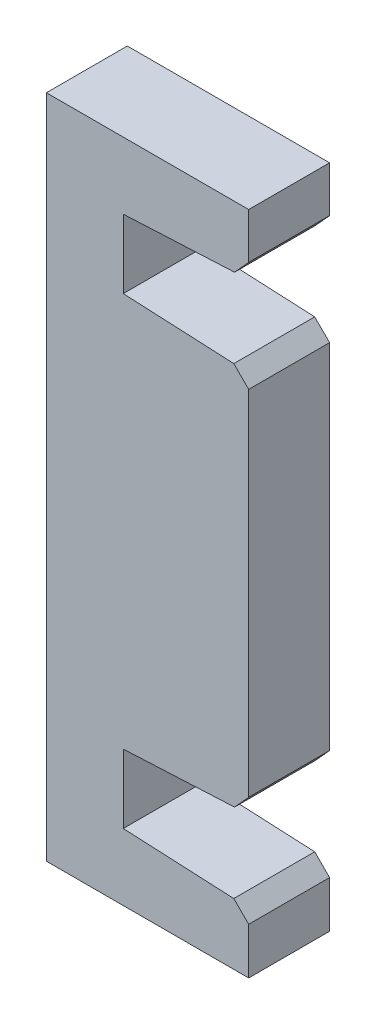
ISO-10303-21;
HEADER;
FILE_DESCRIPTION(('STEP AP214'),'2;1');
FILE_NAME('part.step','',(''),(''),'','','');
FILE_SCHEMA(('AUTOMOTIVE_DESIGN { 1 0 10303 214 1 1 1 1 }'));
ENDSEC;
DATA;
#1=APPLICATION_CONTEXT('core data for automotive mechanical design processes');
#2=APPLICATION_PROTOCOL_DEFINITION('international standard','automotive_design',2000,#1);
#3=PRODUCT_CONTEXT('',#1,'mechanical');
#4=PRODUCT('Part','Part','',(#3));
#5=PRODUCT_RELATED_PRODUCT_CATEGORY('part','',(#4));
#6=PRODUCT_DEFINITION_FORMATION('','',#4);
#7=PRODUCT_DEFINITION_CONTEXT('part definition',#1,'design');
#8=PRODUCT_DEFINITION('design','',#6,#7);
#9=PRODUCT_DEFINITION_SHAPE('','',#8);
#10=(LENGTH_UNIT() NAMED_UNIT(*) SI_UNIT(.MILLI.,.METRE.));
#11=(NAMED_UNIT(*) PLANE_ANGLE_UNIT() SI_UNIT($,.RADIAN.));
#12=(NAMED_UNIT(*) SI_UNIT($,.STERADIAN.) SOLID_ANGLE_UNIT());
#13=UNCERTAINTY_MEASURE_WITH_UNIT(LENGTH_MEASURE(1.E-05),#10,'distance_accuracy_value','');
#14=(GEOMETRIC_REPRESENTATION_CONTEXT(3) GLOBAL_UNCERTAINTY_ASSIGNED_CONTEXT((#13)) GLOBAL_UNIT_ASSIGNED_CONTEXT((#10,
#11,#12)) REPRESENTATION_CONTEXT('',''));
#15=CARTESIAN_POINT('',(0.,0.,0.));
#16=DIRECTION('',(0.,0.,1.));
#17=DIRECTION('',(1.,0.,0.));
#18=AXIS2_PLACEMENT_3D('',#15,#16,#17);
#19=CARTESIAN_POINT('',(-10.,0.,4.));
#20=DIRECTION('',(1.,0.,0.));
#21=DIRECTION('',(0.,0.,-1.));
#22=AXIS2_PLACEMENT_3D('',#19,#20,#21);
#23=PLANE('',#22);
#24=DIRECTION('',(0.,-1.,0.));
#25=VECTOR('',#24,1.);
#26=CARTESIAN_POINT('',(-10.,0.,0.));
#27=LINE('',#26,#25);
#28=CARTESIAN_POINT('',(-10.,16.45,0.));
#29=VERTEX_POINT('',#28);
#30=CARTESIAN_POINT('',(-10.,-16.45,0.));
#31=VERTEX_POINT('',#30);
#32=EDGE_CURVE('E167',#29,#31,#27,.T.);
#33=ORIENTED_EDGE('',*,*,#32,.T.);
#34=DIRECTION('',(0.,0.,-1.));
#35=VECTOR('',#34,1.);
#36=CARTESIAN_POINT('',(-10.,-16.45,4.));
#37=LINE('',#36,#35);
#38=CARTESIAN_POINT('',(-10.,-16.45,4.));
#39=VERTEX_POINT('',#38);
#40=EDGE_CURVE('E165',#39,#31,#37,.T.);
#41=ORIENTED_EDGE('',*,*,#40,.F.);
#42=DIRECTION('',(0.,-1.,0.));
#43=VECTOR('',#42,1.);
#44=CARTESIAN_POINT('',(-10.,0.,4.));
#45=LINE('',#44,#43);
#46=CARTESIAN_POINT('',(-10.,16.45,4.));
#47=VERTEX_POINT('',#46);
#48=EDGE_CURVE('E150',#47,#39,#45,.T.);
#49=ORIENTED_EDGE('',*,*,#48,.F.);
#50=DIRECTION('',(0.,0.,-1.));
#51=VECTOR('',#50,1.);
#52=CARTESIAN_POINT('',(-10.,16.45,4.));
#53=LINE('',#52,#51);
#54=EDGE_CURVE('E201',#47,#29,#53,.T.);
#55=ORIENTED_EDGE('',*,*,#54,.T.);
#56=EDGE_LOOP('',(#33,#41,#49,#55));
#57=FACE_BOUND('',#56,.T.);
#58=ADVANCED_FACE('F37',(#57),#23,.F.);
#59=CARTESIAN_POINT('',(0.,-16.45,4.));
#60=DIRECTION('',(0.,-1.,0.));
#61=DIRECTION('',(0.,0.,-1.));
#62=AXIS2_PLACEMENT_3D('',#59,#60,#61);
#63=PLANE('',#62);
#64=DIRECTION('',(-1.,0.,0.));
#65=VECTOR('',#64,1.);
#66=CARTESIAN_POINT('',(0.,-16.45,0.));
#67=LINE('',#66,#65);
#68=CARTESIAN_POINT('',(0.,-16.45,0.));
#69=VERTEX_POINT('',#68);
#70=EDGE_CURVE('E203',#69,#31,#67,.T.);
#71=ORIENTED_EDGE('',*,*,#70,.F.);
#72=DIRECTION('',(0.,0.,-1.));
#73=VECTOR('',#72,1.);
#74=CARTESIAN_POINT('',(0.,-16.45,4.));
#75=LINE('',#74,#73);
#76=CARTESIAN_POINT('',(0.,-16.45,4.));
#77=VERTEX_POINT('',#76);
#78=EDGE_CURVE('E172',#77,#69,#75,.T.);
#79=ORIENTED_EDGE('',*,*,#78,.F.);
#80=DIRECTION('',(-1.,0.,0.));
#81=VECTOR('',#80,1.);
#82=CARTESIAN_POINT('',(0.,-16.45,4.));
#83=LINE('',#82,#81);
#84=EDGE_CURVE('E156',#77,#39,#83,.T.);
#85=ORIENTED_EDGE('',*,*,#84,.T.);
#86=ORIENTED_EDGE('',*,*,#40,.T.);
#87=EDGE_LOOP('',(#71,#79,#85,#86));
#88=FACE_BOUND('',#87,.T.);
#89=ADVANCED_FACE('F175',(#88),#63,.T.);
#90=CARTESIAN_POINT('',(0.,0.,4.));
#91=DIRECTION('',(1.,0.,0.));
#92=DIRECTION('',(0.,1.,0.));
#93=AXIS2_PLACEMENT_3D('',#90,#91,#92);
#94=PLANE('',#93);
#95=DIRECTION('',(0.,-1.,0.));
#96=VECTOR('',#95,1.);
#97=CARTESIAN_POINT('',(0.,0.,0.));
#98=LINE('',#97,#96);
#99=CARTESIAN_POINT('',(0.,-14.15,0.));
#100=VERTEX_POINT('',#99);
#101=EDGE_CURVE('E205',#100,#69,#98,.T.);
#102=ORIENTED_EDGE('',*,*,#101,.F.);
#103=DIRECTION('',(0.,0.,1.));
#104=VECTOR('',#103,1.);
#105=CARTESIAN_POINT('',(0.,-14.15,4.));
#106=LINE('',#105,#104);
#107=CARTESIAN_POINT('',(0.,-14.15,4.));
#108=VERTEX_POINT('',#107);
#109=EDGE_CURVE('E267',#100,#108,#106,.T.);
#110=ORIENTED_EDGE('',*,*,#109,.T.);
#111=DIRECTION('',(0.,-1.,0.));
#112=VECTOR('',#111,1.);
#113=CARTESIAN_POINT('',(0.,0.,4.));
#114=LINE('',#113,#112);
#115=EDGE_CURVE('E177',#108,#77,#114,.T.);
#116=ORIENTED_EDGE('',*,*,#115,.T.);
#117=ORIENTED_EDGE('',*,*,#78,.T.);
#118=EDGE_LOOP('',(#102,#110,#116,#117));
#119=FACE_BOUND('',#118,.T.);
#120=ADVANCED_FACE('F300',(#119),#94,.T.);
#121=CARTESIAN_POINT('',(-0.649286270438619,-13.4185829223981,4.));
#122=DIRECTION('',(0.0483305514233226,0.998831396082,0.));
#123=DIRECTION('',(-0.998831396082,0.0483305514233226,0.));
#124=AXIS2_PLACEMENT_3D('',#121,#122,#123);
#125=PLANE('',#124);
#126=DIRECTION('',(0.998831396082,-0.0483305514233226,0.));
#127=VECTOR('',#126,1.);
#128=CARTESIAN_POINT('',(-0.649286270438619,-13.4185829223981,4.));
#129=LINE('',#128,#127);
#130=CARTESIAN_POINT('',(-6.20000000000002,-13.15,4.));
#131=VERTEX_POINT('',#130);
#132=CARTESIAN_POINT('',(-0.735593220338908,-13.414406779661,4.));
#133=VERTEX_POINT('',#132);
#134=EDGE_CURVE('E179',#131,#133,#129,.T.);
#135=ORIENTED_EDGE('',*,*,#134,.T.);
#136=DIRECTION('',(0.,0.,-1.));
#137=VECTOR('',#136,1.);
#138=CARTESIAN_POINT('',(-0.735593220338908,-13.414406779661,4.));
#139=LINE('',#138,#137);
#140=CARTESIAN_POINT('',(-0.735593220338908,-13.414406779661,0.));
#141=VERTEX_POINT('',#140);
#142=EDGE_CURVE('E264',#133,#141,#139,.T.);
#143=ORIENTED_EDGE('',*,*,#142,.T.);
#144=DIRECTION('',(0.998831396082,-0.0483305514233226,0.));
#145=VECTOR('',#144,1.);
#146=CARTESIAN_POINT('',(-0.649286270438619,-13.4185829223981,0.));
#147=LINE('',#146,#145);
#148=CARTESIAN_POINT('',(-6.20000000000002,-13.15,0.));
#149=VERTEX_POINT('',#148);
#150=EDGE_CURVE('E207',#149,#141,#147,.T.);
#151=ORIENTED_EDGE('',*,*,#150,.F.);
#152=DIRECTION('',(0.,0.,-1.));
#153=VECTOR('',#152,1.);
#154=CARTESIAN_POINT('',(-6.20000000000002,-13.15,4.));
#155=LINE('',#154,#153);
#156=EDGE_CURVE('E240',#131,#149,#155,.T.);
#157=ORIENTED_EDGE('',*,*,#156,.F.);
#158=EDGE_LOOP('',(#135,#143,#151,#157));
#159=FACE_BOUND('',#158,.T.);
#160=ADVANCED_FACE('F356',(#159),#125,.T.);
#161=CARTESIAN_POINT('',(-6.20000000000002,0.,4.));
#162=DIRECTION('',(1.,0.,0.));
#163=DIRECTION('',(0.,1.,0.));
#164=AXIS2_PLACEMENT_3D('',#161,#162,#163);
#165=PLANE('',#164);
#166=DIRECTION('',(0.,-1.,0.));
#167=VECTOR('',#166,1.);
#168=CARTESIAN_POINT('',(-6.20000000000002,0.,0.));
#169=LINE('',#168,#167);
#170=CARTESIAN_POINT('',(-6.20000000000002,-9.75,0.));
#171=VERTEX_POINT('',#170);
#172=EDGE_CURVE('E210',#171,#149,#169,.T.);
#173=ORIENTED_EDGE('',*,*,#172,.F.);
#174=DIRECTION('',(0.,0.,-1.));
#175=VECTOR('',#174,1.);
#176=CARTESIAN_POINT('',(-6.20000000000002,-9.75,4.));
#177=LINE('',#176,#175);
#178=CARTESIAN_POINT('',(-6.20000000000002,-9.75,4.));
#179=VERTEX_POINT('',#178);
#180=EDGE_CURVE('E237',#179,#171,#177,.T.);
#181=ORIENTED_EDGE('',*,*,#180,.F.);
#182=DIRECTION('',(0.,-1.,0.));
#183=VECTOR('',#182,1.);
#184=CARTESIAN_POINT('',(-6.20000000000002,0.,4.));
#185=LINE('',#184,#183);
#186=EDGE_CURVE('E184',#179,#131,#185,.T.);
#187=ORIENTED_EDGE('',*,*,#186,.T.);
#188=ORIENTED_EDGE('',*,*,#156,.T.);
#189=EDGE_LOOP('',(#173,#181,#187,#188));
#190=FACE_BOUND('',#189,.T.);
#191=ADVANCED_FACE('F352',(#190),#165,.T.);
#192=CARTESIAN_POINT('',(0.456189981832338,-9.42792629120166,4.));
#193=DIRECTION('',(0.0483305514233226,-0.998831396082,0.));
#194=DIRECTION('',(0.998831396082,0.0483305514233226,0.));
#195=AXIS2_PLACEMENT_3D('',#192,#193,#194);
#196=PLANE('',#195);
#197=DIRECTION('',(-0.998831396082,-0.0483305514233226,0.));
#198=VECTOR('',#197,1.);
#199=CARTESIAN_POINT('',(0.456189981832338,-9.42792629120166,0.));
#200=LINE('',#199,#198);
#201=CARTESIAN_POINT('',(-0.699181977257407,-9.48383138599633,0.));
#202=VERTEX_POINT('',#201);
#203=EDGE_CURVE('E213',#202,#171,#200,.T.);
#204=ORIENTED_EDGE('',*,*,#203,.F.);
#205=DIRECTION('',(0.,0.,1.));
#206=VECTOR('',#205,1.);
#207=CARTESIAN_POINT('',(-0.699181977257407,-9.48383138599633,4.));
#208=LINE('',#207,#206);
#209=CARTESIAN_POINT('',(-0.699181977257407,-9.48383138599633,4.));
#210=VERTEX_POINT('',#209);
#211=EDGE_CURVE('E255',#202,#210,#208,.T.);
#212=ORIENTED_EDGE('',*,*,#211,.T.);
#213=DIRECTION('',(-0.998831396082,-0.0483305514233226,0.));
#214=VECTOR('',#213,1.);
#215=CARTESIAN_POINT('',(0.456189981832338,-9.42792629120166,4.));
#216=LINE('',#215,#214);
#217=EDGE_CURVE('E187',#210,#179,#216,.T.);
#218=ORIENTED_EDGE('',*,*,#217,.T.);
#219=ORIENTED_EDGE('',*,*,#180,.T.);
#220=EDGE_LOOP('',(#204,#212,#218,#219));
#221=FACE_BOUND('',#220,.T.);
#222=ADVANCED_FACE('F347',(#221),#196,.T.);
#223=CARTESIAN_POINT('',(0.,0.,4.));
#224=DIRECTION('',(-1.,0.,0.));
#225=DIRECTION('',(0.,-1.,0.));
#226=AXIS2_PLACEMENT_3D('',#223,#224,#225);
#227=PLANE('',#226);
#228=DIRECTION('',(0.,1.,0.));
#229=VECTOR('',#228,1.);
#230=CARTESIAN_POINT('',(0.,0.,4.));
#231=LINE('',#230,#229);
#232=CARTESIAN_POINT('',(0.,-8.71354615681445,4.));
#233=VERTEX_POINT('',#232);
#234=CARTESIAN_POINT('',(0.,8.75,4.));
#235=VERTEX_POINT('',#234);
#236=EDGE_CURVE('E189',#233,#235,#231,.T.);
#237=ORIENTED_EDGE('',*,*,#236,.F.);
#238=DIRECTION('',(0.,0.,-1.));
#239=VECTOR('',#238,1.);
#240=CARTESIAN_POINT('',(0.,-8.71354615681445,0.));
#241=LINE('',#240,#239);
#242=CARTESIAN_POINT('',(0.,-8.71354615681445,0.));
#243=VERTEX_POINT('',#242);
#244=EDGE_CURVE('E244',#233,#243,#241,.T.);
#245=ORIENTED_EDGE('',*,*,#244,.T.);
#246=DIRECTION('',(0.,1.,0.));
#247=VECTOR('',#246,1.);
#248=CARTESIAN_POINT('',(0.,0.,0.));
#249=LINE('',#248,#247);
#250=CARTESIAN_POINT('',(0.,8.75,0.));
#251=VERTEX_POINT('',#250);
#252=EDGE_CURVE('E215',#243,#251,#249,.T.);
#253=ORIENTED_EDGE('',*,*,#252,.T.);
#254=DIRECTION('',(0.,0.,1.));
#255=VECTOR('',#254,1.);
#256=CARTESIAN_POINT('',(0.,8.75,4.));
#257=LINE('',#256,#255);
#258=EDGE_CURVE('E171',#251,#235,#257,.T.);
#259=ORIENTED_EDGE('',*,*,#258,.T.);
#260=EDGE_LOOP('',(#237,#245,#253,#259));
#261=FACE_BOUND('',#260,.T.);
#262=ADVANCED_FACE('F341',(#261),#227,.F.);
#263=CARTESIAN_POINT('',(0.456189981832333,9.42792629120167,4.));
#264=DIRECTION('',(-0.048330551423322,-0.998831396082,0.));
#265=DIRECTION('',(0.998831396082,-0.048330551423322,0.));
#266=AXIS2_PLACEMENT_3D('',#263,#264,#265);
#267=PLANE('',#266);
#268=DIRECTION('',(-0.998831396082,0.048330551423322,0.));
#269=VECTOR('',#268,1.);
#270=CARTESIAN_POINT('',(0.456189981832333,9.42792629120167,4.));
#271=LINE('',#270,#269);
#272=CARTESIAN_POINT('',(-0.735593220338984,9.48559322033899,4.));
#273=VERTEX_POINT('',#272);
#274=CARTESIAN_POINT('',(-6.20000000000002,9.75,4.));
#275=VERTEX_POINT('',#274);
#276=EDGE_CURVE('E192',#273,#275,#271,.T.);
#277=ORIENTED_EDGE('',*,*,#276,.F.);
#278=DIRECTION('',(0.,0.,-1.));
#279=VECTOR('',#278,1.);
#280=CARTESIAN_POINT('',(-0.735593220338983,9.48559322033899,4.));
#281=LINE('',#280,#279);
#282=CARTESIAN_POINT('',(-0.735593220338984,9.48559322033899,0.));
#283=VERTEX_POINT('',#282);
#284=EDGE_CURVE('E269',#273,#283,#281,.T.);
#285=ORIENTED_EDGE('',*,*,#284,.T.);
#286=DIRECTION('',(-0.998831396082,0.048330551423322,0.));
#287=VECTOR('',#286,1.);
#288=CARTESIAN_POINT('',(0.456189981832333,9.42792629120167,0.));
#289=LINE('',#288,#287);
#290=CARTESIAN_POINT('',(-6.20000000000002,9.75,0.));
#291=VERTEX_POINT('',#290);
#292=EDGE_CURVE('E218',#283,#291,#289,.T.);
#293=ORIENTED_EDGE('',*,*,#292,.T.);
#294=DIRECTION('',(0.,0.,-1.));
#295=VECTOR('',#294,1.);
#296=CARTESIAN_POINT('',(-6.20000000000002,9.75,4.));
#297=LINE('',#296,#295);
#298=EDGE_CURVE('E234',#275,#291,#297,.T.);
#299=ORIENTED_EDGE('',*,*,#298,.F.);
#300=EDGE_LOOP('',(#277,#285,#293,#299));
#301=FACE_BOUND('',#300,.T.);
#302=ADVANCED_FACE('F333',(#301),#267,.F.);
#303=CARTESIAN_POINT('',(-6.20000000000002,0.,4.));
#304=DIRECTION('',(-1.,0.,0.));
#305=DIRECTION('',(0.,-1.,0.));
#306=AXIS2_PLACEMENT_3D('',#303,#304,#305);
#307=PLANE('',#306);
#308=DIRECTION('',(0.,1.,0.));
#309=VECTOR('',#308,1.);
#310=CARTESIAN_POINT('',(-6.20000000000002,0.,0.));
#311=LINE('',#310,#309);
#312=CARTESIAN_POINT('',(-6.20000000000002,13.15,0.));
#313=VERTEX_POINT('',#312);
#314=EDGE_CURVE('E220',#291,#313,#311,.T.);
#315=ORIENTED_EDGE('',*,*,#314,.T.);
#316=DIRECTION('',(0.,0.,-1.));
#317=VECTOR('',#316,1.);
#318=CARTESIAN_POINT('',(-6.20000000000002,13.15,4.));
#319=LINE('',#318,#317);
#320=CARTESIAN_POINT('',(-6.20000000000002,13.15,4.));
#321=VERTEX_POINT('',#320);
#322=EDGE_CURVE('E231',#321,#313,#319,.T.);
#323=ORIENTED_EDGE('',*,*,#322,.F.);
#324=DIRECTION('',(0.,1.,0.));
#325=VECTOR('',#324,1.);
#326=CARTESIAN_POINT('',(-6.20000000000002,0.,4.));
#327=LINE('',#326,#325);
#328=EDGE_CURVE('E194',#275,#321,#327,.T.);
#329=ORIENTED_EDGE('',*,*,#328,.F.);
#330=ORIENTED_EDGE('',*,*,#298,.T.);
#331=EDGE_LOOP('',(#315,#323,#329,#330));
#332=FACE_BOUND('',#331,.T.);
#333=ADVANCED_FACE('F339',(#332),#307,.F.);
#334=CARTESIAN_POINT('',(-0.649286270438627,13.4185829223981,4.));
#335=DIRECTION('',(-0.0483305514233231,0.998831396082,0.));
#336=DIRECTION('',(-0.998831396082,-0.0483305514233231,0.));
#337=AXIS2_PLACEMENT_3D('',#334,#335,#336);
#338=PLANE('',#337);
#339=DIRECTION('',(0.998831396082,0.0483305514233231,0.));
#340=VECTOR('',#339,1.);
#341=CARTESIAN_POINT('',(-0.649286270438627,13.4185829223981,0.));
#342=LINE('',#341,#340);
#343=CARTESIAN_POINT('',(-0.699181977257429,13.4161686140037,0.));
#344=VERTEX_POINT('',#343);
#345=EDGE_CURVE('E222',#313,#344,#342,.T.);
#346=ORIENTED_EDGE('',*,*,#345,.T.);
#347=DIRECTION('',(0.,0.,1.));
#348=VECTOR('',#347,1.);
#349=CARTESIAN_POINT('',(-0.699181977257429,13.4161686140037,4.));
#350=LINE('',#349,#348);
#351=CARTESIAN_POINT('',(-0.699181977257429,13.4161686140037,4.));
#352=VERTEX_POINT('',#351);
#353=EDGE_CURVE('E11',#344,#352,#350,.T.);
#354=ORIENTED_EDGE('',*,*,#353,.T.);
#355=DIRECTION('',(0.998831396082,0.0483305514233231,0.));
#356=VECTOR('',#355,1.);
#357=CARTESIAN_POINT('',(-0.649286270438627,13.4185829223981,4.));
#358=LINE('',#357,#356);
#359=EDGE_CURVE('E196',#321,#352,#358,.T.);
#360=ORIENTED_EDGE('',*,*,#359,.F.);
#361=ORIENTED_EDGE('',*,*,#322,.T.);
#362=EDGE_LOOP('',(#346,#354,#360,#361));
#363=FACE_BOUND('',#362,.T.);
#364=ADVANCED_FACE('F292',(#363),#338,.F.);
#365=CARTESIAN_POINT('',(0.,0.,4.));
#366=DIRECTION('',(-1.,0.,0.));
#367=DIRECTION('',(0.,-1.,0.));
#368=AXIS2_PLACEMENT_3D('',#365,#366,#367);
#369=PLANE('',#368);
#370=DIRECTION('',(0.,1.,0.));
#371=VECTOR('',#370,1.);
#372=CARTESIAN_POINT('',(0.,0.,4.));
#373=LINE('',#372,#371);
#374=CARTESIAN_POINT('',(0.,14.1864538431857,4.));
#375=VERTEX_POINT('',#374);
#376=CARTESIAN_POINT('',(0.,16.45,4.));
#377=VERTEX_POINT('',#376);
#378=EDGE_CURVE('E198',#375,#377,#373,.T.);
#379=ORIENTED_EDGE('',*,*,#378,.F.);
#380=DIRECTION('',(0.,0.,-1.));
#381=VECTOR('',#380,1.);
#382=CARTESIAN_POINT('',(0.,14.1864538431857,4.));
#383=LINE('',#382,#381);
#384=CARTESIAN_POINT('',(0.,14.1864538431857,0.));
#385=VERTEX_POINT('',#384);
#386=EDGE_CURVE('E46',#375,#385,#383,.T.);
#387=ORIENTED_EDGE('',*,*,#386,.T.);
#388=DIRECTION('',(0.,1.,0.));
#389=VECTOR('',#388,1.);
#390=CARTESIAN_POINT('',(0.,0.,0.));
#391=LINE('',#390,#389);
#392=CARTESIAN_POINT('',(0.,16.45,0.));
#393=VERTEX_POINT('',#392);
#394=EDGE_CURVE('E224',#385,#393,#391,.T.);
#395=ORIENTED_EDGE('',*,*,#394,.T.);
#396=DIRECTION('',(0.,0.,-1.));
#397=VECTOR('',#396,1.);
#398=CARTESIAN_POINT('',(0.,16.45,4.));
#399=LINE('',#398,#397);
#400=EDGE_CURVE('E228',#377,#393,#399,.T.);
#401=ORIENTED_EDGE('',*,*,#400,.F.);
#402=EDGE_LOOP('',(#379,#387,#395,#401));
#403=FACE_BOUND('',#402,.T.);
#404=ADVANCED_FACE('F275',(#403),#369,.F.);
#405=CARTESIAN_POINT('',(0.,16.45,4.));
#406=DIRECTION('',(0.,-1.,0.));
#407=DIRECTION('',(0.,0.,-1.));
#408=AXIS2_PLACEMENT_3D('',#405,#406,#407);
#409=PLANE('',#408);
#410=DIRECTION('',(-1.,0.,0.));
#411=VECTOR('',#410,1.);
#412=CARTESIAN_POINT('',(0.,16.45,0.));
#413=LINE('',#412,#411);
#414=EDGE_CURVE('E162',#393,#29,#413,.T.);
#415=ORIENTED_EDGE('',*,*,#414,.T.);
#416=ORIENTED_EDGE('',*,*,#54,.F.);
#417=DIRECTION('',(-1.,0.,0.));
#418=VECTOR('',#417,1.);
#419=CARTESIAN_POINT('',(0.,16.45,4.));
#420=LINE('',#419,#418);
#421=EDGE_CURVE('E158',#377,#47,#420,.T.);
#422=ORIENTED_EDGE('',*,*,#421,.F.);
#423=ORIENTED_EDGE('',*,*,#400,.T.);
#424=EDGE_LOOP('',(#415,#416,#422,#423));
#425=FACE_BOUND('',#424,.T.);
#426=ADVANCED_FACE('F284',(#425),#409,.F.);
#427=CARTESIAN_POINT('',(0.,0.,4.));
#428=DIRECTION('',(0.,0.,1.));
#429=DIRECTION('',(1.,0.,0.));
#430=AXIS2_PLACEMENT_3D('',#427,#428,#429);
#431=PLANE('',#430);
#432=ORIENTED_EDGE('',*,*,#217,.F.);
#433=DIRECTION('',(0.672105592781695,0.740455314081522,0.));
#434=VECTOR('',#433,1.);
#435=CARTESIAN_POINT('',(4.3364196095748,-3.93613472253716,4.));
#436=LINE('',#435,#434);
#437=EDGE_CURVE('E262',#210,#233,#436,.T.);
#438=ORIENTED_EDGE('',*,*,#437,.T.);
#439=ORIENTED_EDGE('',*,*,#236,.T.);
#440=DIRECTION('',(0.707106781186547,-0.707106781186548,0.));
#441=VECTOR('',#440,1.);
#442=CARTESIAN_POINT('',(4.375,4.37499999999999,4.));
#443=LINE('',#442,#441);
#444=EDGE_CURVE('E258',#235,#273,#443,.F.);
#445=ORIENTED_EDGE('',*,*,#444,.T.);
#446=ORIENTED_EDGE('',*,*,#276,.T.);
#447=ORIENTED_EDGE('',*,*,#328,.T.);
#448=ORIENTED_EDGE('',*,*,#359,.T.);
#449=DIRECTION('',(-0.672105592781694,-0.740455314081524,0.));
#450=VECTOR('',#449,1.);
#451=CARTESIAN_POINT('',(-7.06008960402501,6.40838902519196,4.));
#452=LINE('',#451,#450);
#453=EDGE_CURVE('E53',#352,#375,#452,.F.);
#454=ORIENTED_EDGE('',*,*,#453,.T.);
#455=ORIENTED_EDGE('',*,*,#378,.T.);
#456=ORIENTED_EDGE('',*,*,#421,.T.);
#457=ORIENTED_EDGE('',*,*,#48,.T.);
#458=ORIENTED_EDGE('',*,*,#84,.F.);
#459=ORIENTED_EDGE('',*,*,#115,.F.);
#460=DIRECTION('',(0.707106781186549,-0.707106781186546,0.));
#461=VECTOR('',#460,1.);
#462=CARTESIAN_POINT('',(-7.07499999999996,-7.075,4.));
#463=LINE('',#462,#461);
#464=EDGE_CURVE('E260',#108,#133,#463,.F.);
#465=ORIENTED_EDGE('',*,*,#464,.T.);
#466=ORIENTED_EDGE('',*,*,#134,.F.);
#467=ORIENTED_EDGE('',*,*,#186,.F.);
#468=EDGE_LOOP('',(#432,#438,#439,#445,#446,#447,#448,#454,#455,#456,#457,#458,#459,#465,#466,#467));
#469=FACE_BOUND('',#468,.T.);
#470=ADVANCED_FACE('F153',(#469),#431,.T.);
#471=CARTESIAN_POINT('',(0.,0.,0.));
#472=DIRECTION('',(0.,0.,1.));
#473=DIRECTION('',(1.,0.,0.));
#474=AXIS2_PLACEMENT_3D('',#471,#472,#473);
#475=PLANE('',#474);
#476=ORIENTED_EDGE('',*,*,#252,.F.);
#477=DIRECTION('',(-0.672105592781695,-0.740455314081522,0.));
#478=VECTOR('',#477,1.);
#479=CARTESIAN_POINT('',(0.,-8.71354615681445,0.));
#480=LINE('',#479,#478);
#481=EDGE_CURVE('E253',#243,#202,#480,.T.);
#482=ORIENTED_EDGE('',*,*,#481,.T.);
#483=ORIENTED_EDGE('',*,*,#203,.T.);
#484=ORIENTED_EDGE('',*,*,#172,.T.);
#485=ORIENTED_EDGE('',*,*,#150,.T.);
#486=DIRECTION('',(-0.707106781186549,0.707106781186546,0.));
#487=VECTOR('',#486,1.);
#488=CARTESIAN_POINT('',(-0.735593220338907,-13.414406779661,0.));
#489=LINE('',#488,#487);
#490=EDGE_CURVE('E251',#141,#100,#489,.F.);
#491=ORIENTED_EDGE('',*,*,#490,.T.);
#492=ORIENTED_EDGE('',*,*,#101,.T.);
#493=ORIENTED_EDGE('',*,*,#70,.T.);
#494=ORIENTED_EDGE('',*,*,#32,.F.);
#495=ORIENTED_EDGE('',*,*,#414,.F.);
#496=ORIENTED_EDGE('',*,*,#394,.F.);
#497=DIRECTION('',(0.672105592781694,0.740455314081524,0.));
#498=VECTOR('',#497,1.);
#499=CARTESIAN_POINT('',(0.,14.1864538431857,0.));
#500=LINE('',#499,#498);
#501=EDGE_CURVE('E247',#385,#344,#500,.F.);
#502=ORIENTED_EDGE('',*,*,#501,.T.);
#503=ORIENTED_EDGE('',*,*,#345,.F.);
#504=ORIENTED_EDGE('',*,*,#314,.F.);
#505=ORIENTED_EDGE('',*,*,#292,.F.);
#506=DIRECTION('',(-0.707106781186547,0.707106781186548,0.));
#507=VECTOR('',#506,1.);
#508=CARTESIAN_POINT('',(-0.735593220338983,9.48559322033899,0.));
#509=LINE('',#508,#507);
#510=EDGE_CURVE('E249',#283,#251,#509,.F.);
#511=ORIENTED_EDGE('',*,*,#510,.T.);
#512=EDGE_LOOP('',(#476,#482,#483,#484,#485,#491,#492,#493,#494,#495,#496,#502,#503,#504,#505,#511));
#513=FACE_BOUND('',#512,.T.);
#514=ADVANCED_FACE('F281',(#513),#475,.F.);
#515=CARTESIAN_POINT('',(0.,-8.71354615681445,4.));
#516=DIRECTION('',(0.740455314081522,-0.672105592781695,0.));
#517=DIRECTION('',(0.,0.,1.));
#518=AXIS2_PLACEMENT_3D('',#515,#516,#517);
#519=PLANE('',#518);
#520=ORIENTED_EDGE('',*,*,#437,.F.);
#521=ORIENTED_EDGE('',*,*,#211,.F.);
#522=ORIENTED_EDGE('',*,*,#481,.F.);
#523=ORIENTED_EDGE('',*,*,#244,.F.);
#524=EDGE_LOOP('',(#520,#521,#522,#523));
#525=FACE_BOUND('',#524,.T.);
#526=ADVANCED_FACE('F305',(#525),#519,.T.);
#527=CARTESIAN_POINT('',(-0.735593220338907,-13.414406779661,4.));
#528=DIRECTION('',(-0.707106781186546,-0.707106781186549,0.));
#529=DIRECTION('',(0.,0.,-1.));
#530=AXIS2_PLACEMENT_3D('',#527,#528,#529);
#531=PLANE('',#530);
#532=ORIENTED_EDGE('',*,*,#464,.F.);
#533=ORIENTED_EDGE('',*,*,#109,.F.);
#534=ORIENTED_EDGE('',*,*,#490,.F.);
#535=ORIENTED_EDGE('',*,*,#142,.F.);
#536=EDGE_LOOP('',(#532,#533,#534,#535));
#537=FACE_BOUND('',#536,.T.);
#538=ADVANCED_FACE('F311',(#537),#531,.F.);
#539=CARTESIAN_POINT('',(-0.735593220338983,9.48559322033899,4.));
#540=DIRECTION('',(-0.707106781186548,-0.707106781186547,0.));
#541=DIRECTION('',(0.,0.,-1.));
#542=AXIS2_PLACEMENT_3D('',#539,#540,#541);
#543=PLANE('',#542);
#544=ORIENTED_EDGE('',*,*,#444,.F.);
#545=ORIENTED_EDGE('',*,*,#258,.F.);
#546=ORIENTED_EDGE('',*,*,#510,.F.);
#547=ORIENTED_EDGE('',*,*,#284,.F.);
#548=EDGE_LOOP('',(#544,#545,#546,#547));
#549=FACE_BOUND('',#548,.T.);
#550=ADVANCED_FACE('F317',(#549),#543,.F.);
#551=CARTESIAN_POINT('',(0.,14.1864538431857,4.));
#552=DIRECTION('',(-0.740455314081524,0.672105592781694,0.));
#553=DIRECTION('',(0.,0.,-1.));
#554=AXIS2_PLACEMENT_3D('',#551,#552,#553);
#555=PLANE('',#554);
#556=ORIENTED_EDGE('',*,*,#453,.F.);
#557=ORIENTED_EDGE('',*,*,#353,.F.);
#558=ORIENTED_EDGE('',*,*,#501,.F.);
#559=ORIENTED_EDGE('',*,*,#386,.F.);
#560=EDGE_LOOP('',(#556,#557,#558,#559));
#561=FACE_BOUND('',#560,.T.);
#562=ADVANCED_FACE('F40',(#561),#555,.F.);
#563=CLOSED_SHELL('',(#58,#89,#120,#160,#191,#222,#262,#302,#333,#364,#404,#426,#470,#514,#526,
#538,#550,#562));
#564=MANIFOLD_SOLID_BREP('B2',#563);
#565=ADVANCED_BREP_SHAPE_REPRESENTATION('',(#18,#564),#14);
#566=SHAPE_DEFINITION_REPRESENTATION(#9,#565);
ENDSEC;
END-ISO-10303-21;
